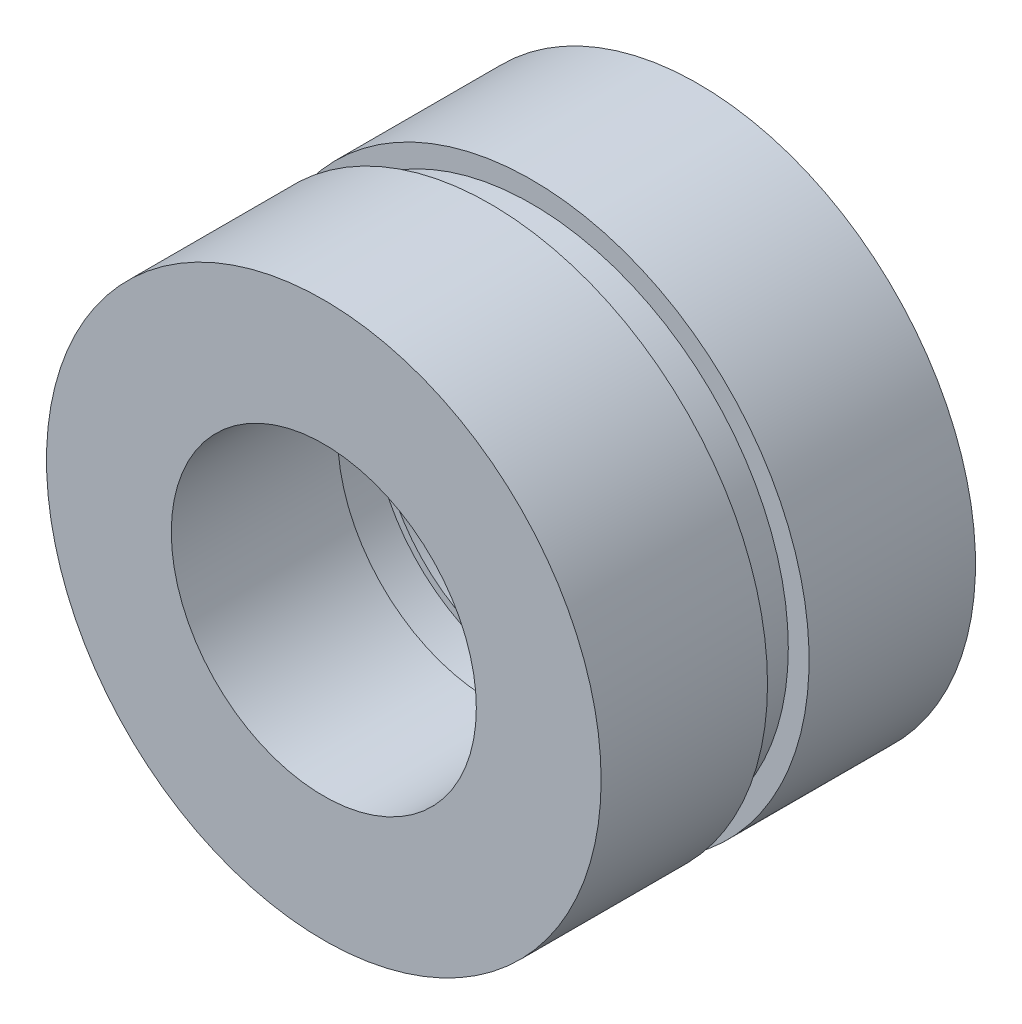
ISO-10303-21;
HEADER;
FILE_DESCRIPTION(('STEP AP214'),'2;1');
FILE_NAME('part.step','',(''),(''),'','','');
FILE_SCHEMA(('AUTOMOTIVE_DESIGN { 1 0 10303 214 1 1 1 1 }'));
ENDSEC;
DATA;
#1=APPLICATION_CONTEXT('core data for automotive mechanical design processes');
#2=APPLICATION_PROTOCOL_DEFINITION('international standard','automotive_design',2000,#1);
#3=PRODUCT_CONTEXT('',#1,'mechanical');
#4=PRODUCT('Part','Part','',(#3));
#5=PRODUCT_RELATED_PRODUCT_CATEGORY('part','',(#4));
#6=PRODUCT_DEFINITION_FORMATION('','',#4);
#7=PRODUCT_DEFINITION_CONTEXT('part definition',#1,'design');
#8=PRODUCT_DEFINITION('design','',#6,#7);
#9=PRODUCT_DEFINITION_SHAPE('','',#8);
#10=(LENGTH_UNIT() NAMED_UNIT(*) SI_UNIT(.MILLI.,.METRE.));
#11=(NAMED_UNIT(*) PLANE_ANGLE_UNIT() SI_UNIT($,.RADIAN.));
#12=(NAMED_UNIT(*) SI_UNIT($,.STERADIAN.) SOLID_ANGLE_UNIT());
#13=UNCERTAINTY_MEASURE_WITH_UNIT(LENGTH_MEASURE(1.E-05),#10,'distance_accuracy_value','');
#14=(GEOMETRIC_REPRESENTATION_CONTEXT(3) GLOBAL_UNCERTAINTY_ASSIGNED_CONTEXT((#13)) GLOBAL_UNIT_ASSIGNED_CONTEXT((#10,
#11,#12)) REPRESENTATION_CONTEXT('',''));
#15=CARTESIAN_POINT('',(0.,0.,0.));
#16=DIRECTION('',(0.,0.,1.));
#17=DIRECTION('',(1.,0.,0.));
#18=AXIS2_PLACEMENT_3D('',#15,#16,#17);
#19=CARTESIAN_POINT('',(0.,0.,-3.048));
#20=DIRECTION('',(0.,0.,-1.));
#21=DIRECTION('',(-1.,0.,0.));
#22=AXIS2_PLACEMENT_3D('',#19,#20,#21);
#23=PLANE('',#22);
#24=CARTESIAN_POINT('',(0.,0.,-3.048));
#25=DIRECTION('',(0.,0.,-1.));
#26=DIRECTION('',(-1.,0.,0.));
#27=AXIS2_PLACEMENT_3D('',#24,#25,#26);
#28=CIRCLE('',#27,5.08);
#29=CARTESIAN_POINT('',(-5.08,0.,-3.048));
#30=VERTEX_POINT('',#29);
#31=EDGE_CURVE('E11',#30,#30,#28,.T.);
#32=ORIENTED_EDGE('',*,*,#31,.T.);
#33=EDGE_LOOP('',(#32));
#34=FACE_BOUND('',#33,.T.);
#35=CARTESIAN_POINT('',(0.,0.,-3.048));
#36=DIRECTION('',(0.,0.,-1.));
#37=DIRECTION('',(-1.,0.,0.));
#38=AXIS2_PLACEMENT_3D('',#35,#36,#37);
#39=CIRCLE('',#38,2.794);
#40=CARTESIAN_POINT('',(-2.794,0.,-3.048));
#41=VERTEX_POINT('',#40);
#42=EDGE_CURVE('E52',#41,#41,#39,.T.);
#43=ORIENTED_EDGE('',*,*,#42,.F.);
#44=EDGE_LOOP('',(#43));
#45=FACE_BOUND('',#44,.T.);
#46=ADVANCED_FACE('F41',(#34,#45),#23,.T.);
#47=CARTESIAN_POINT('',(0.,0.,0.));
#48=DIRECTION('',(0.,0.,-1.));
#49=DIRECTION('',(-1.,0.,0.));
#50=AXIS2_PLACEMENT_3D('',#47,#48,#49);
#51=PLANE('',#50);
#52=CARTESIAN_POINT('',(0.,0.,0.));
#53=DIRECTION('',(0.,0.,-1.));
#54=DIRECTION('',(-1.,0.,0.));
#55=AXIS2_PLACEMENT_3D('',#52,#53,#54);
#56=CIRCLE('',#55,5.08);
#57=CARTESIAN_POINT('',(-5.08,0.,0.));
#58=VERTEX_POINT('',#57);
#59=EDGE_CURVE('E45',#58,#58,#56,.T.);
#60=ORIENTED_EDGE('',*,*,#59,.F.);
#61=EDGE_LOOP('',(#60));
#62=FACE_BOUND('',#61,.T.);
#63=CARTESIAN_POINT('',(0.,0.,0.));
#64=DIRECTION('',(0.,0.,-1.));
#65=DIRECTION('',(-1.,0.,0.));
#66=AXIS2_PLACEMENT_3D('',#63,#64,#65);
#67=CIRCLE('',#66,2.794);
#68=CARTESIAN_POINT('',(-2.794,0.,0.));
#69=VERTEX_POINT('',#68);
#70=EDGE_CURVE('E54',#69,#69,#67,.T.);
#71=ORIENTED_EDGE('',*,*,#70,.T.);
#72=EDGE_LOOP('',(#71));
#73=FACE_BOUND('',#72,.T.);
#74=ADVANCED_FACE('F64',(#62,#73),#51,.F.);
#75=CARTESIAN_POINT('',(0.,0.,-3.048));
#76=DIRECTION('',(0.,0.,1.));
#77=DIRECTION('',(1.,0.,0.));
#78=AXIS2_PLACEMENT_3D('',#75,#76,#77);
#79=CYLINDRICAL_SURFACE('',#78,5.08);
#80=ORIENTED_EDGE('',*,*,#31,.F.);
#81=EDGE_LOOP('',(#80));
#82=FACE_BOUND('',#81,.T.);
#83=ORIENTED_EDGE('',*,*,#59,.T.);
#84=EDGE_LOOP('',(#83));
#85=FACE_BOUND('',#84,.T.);
#86=ADVANCED_FACE('F43',(#82,#85),#79,.T.);
#87=CARTESIAN_POINT('',(0.,0.,-3.048));
#88=DIRECTION('',(0.,0.,1.));
#89=DIRECTION('',(1.,0.,0.));
#90=AXIS2_PLACEMENT_3D('',#87,#88,#89);
#91=CYLINDRICAL_SURFACE('',#90,2.794);
#92=ORIENTED_EDGE('',*,*,#42,.T.);
#93=EDGE_LOOP('',(#92));
#94=FACE_BOUND('',#93,.T.);
#95=ORIENTED_EDGE('',*,*,#70,.F.);
#96=EDGE_LOOP('',(#95));
#97=FACE_BOUND('',#96,.T.);
#98=ADVANCED_FACE('F60',(#94,#97),#91,.F.);
#99=CLOSED_SHELL('',(#46,#74,#86,#98));
#100=MANIFOLD_SOLID_BREP('B2',#99);
#101=CARTESIAN_POINT('',(0.,0.,0.));
#102=DIRECTION('',(0.,0.,1.));
#103=DIRECTION('',(1.,0.,0.));
#104=AXIS2_PLACEMENT_3D('',#101,#102,#103);
#105=PLANE('',#104);
#106=CARTESIAN_POINT('',(0.,0.,0.));
#107=DIRECTION('',(0.,0.,1.));
#108=DIRECTION('',(1.,0.,0.));
#109=AXIS2_PLACEMENT_3D('',#106,#107,#108);
#110=CIRCLE('',#109,4.699);
#111=CARTESIAN_POINT('',(4.699,0.,0.));
#112=VERTEX_POINT('',#111);
#113=EDGE_CURVE('E107',#112,#112,#110,.T.);
#114=ORIENTED_EDGE('',*,*,#113,.F.);
#115=EDGE_LOOP('',(#114));
#116=FACE_BOUND('',#115,.T.);
#117=CARTESIAN_POINT('',(0.,0.,0.));
#118=DIRECTION('',(0.,0.,1.));
#119=DIRECTION('',(1.,0.,0.));
#120=AXIS2_PLACEMENT_3D('',#117,#118,#119);
#121=CIRCLE('',#120,2.921);
#122=CARTESIAN_POINT('',(2.921,0.,0.));
#123=VERTEX_POINT('',#122);
#124=EDGE_CURVE('E114',#123,#123,#121,.T.);
#125=ORIENTED_EDGE('',*,*,#124,.T.);
#126=EDGE_LOOP('',(#125));
#127=FACE_BOUND('',#126,.T.);
#128=ADVANCED_FACE('F103',(#116,#127),#105,.F.);
#129=CARTESIAN_POINT('',(0.,0.,0.762));
#130=DIRECTION('',(0.,0.,-1.));
#131=DIRECTION('',(-1.,0.,0.));
#132=AXIS2_PLACEMENT_3D('',#129,#130,#131);
#133=CYLINDRICAL_SURFACE('',#132,4.699);
#134=CARTESIAN_POINT('',(0.,0.,0.762));
#135=DIRECTION('',(0.,0.,1.));
#136=DIRECTION('',(1.,0.,0.));
#137=AXIS2_PLACEMENT_3D('',#134,#135,#136);
#138=CIRCLE('',#137,4.699);
#139=CARTESIAN_POINT('',(4.699,0.,0.762));
#140=VERTEX_POINT('',#139);
#141=EDGE_CURVE('E40',#140,#140,#138,.T.);
#142=ORIENTED_EDGE('',*,*,#141,.F.);
#143=EDGE_LOOP('',(#142));
#144=FACE_BOUND('',#143,.T.);
#145=ORIENTED_EDGE('',*,*,#113,.T.);
#146=EDGE_LOOP('',(#145));
#147=FACE_BOUND('',#146,.T.);
#148=ADVANCED_FACE('F105',(#144,#147),#133,.T.);
#149=CARTESIAN_POINT('',(0.,0.,0.762));
#150=DIRECTION('',(0.,0.,-1.));
#151=DIRECTION('',(-1.,0.,0.));
#152=AXIS2_PLACEMENT_3D('',#149,#150,#151);
#153=CYLINDRICAL_SURFACE('',#152,2.921);
#154=CARTESIAN_POINT('',(0.,0.,0.762));
#155=DIRECTION('',(0.,0.,1.));
#156=DIRECTION('',(1.,0.,0.));
#157=AXIS2_PLACEMENT_3D('',#154,#155,#156);
#158=CIRCLE('',#157,2.921);
#159=CARTESIAN_POINT('',(2.921,0.,0.762));
#160=VERTEX_POINT('',#159);
#161=EDGE_CURVE('E118',#160,#160,#158,.T.);
#162=ORIENTED_EDGE('',*,*,#161,.T.);
#163=EDGE_LOOP('',(#162));
#164=FACE_BOUND('',#163,.T.);
#165=ORIENTED_EDGE('',*,*,#124,.F.);
#166=EDGE_LOOP('',(#165));
#167=FACE_BOUND('',#166,.T.);
#168=ADVANCED_FACE('F149',(#164,#167),#153,.F.);
#169=CARTESIAN_POINT('',(0.,0.,0.762));
#170=DIRECTION('',(0.,0.,1.));
#171=DIRECTION('',(1.,0.,0.));
#172=AXIS2_PLACEMENT_3D('',#169,#170,#171);
#173=PLANE('',#172);
#174=CARTESIAN_POINT('',(0.,0.,0.762));
#175=DIRECTION('',(0.,0.,1.));
#176=DIRECTION('',(1.,0.,0.));
#177=AXIS2_PLACEMENT_3D('',#174,#175,#176);
#178=CIRCLE('',#177,2.794);
#179=CARTESIAN_POINT('',(2.794,0.,0.762));
#180=VERTEX_POINT('',#179);
#181=EDGE_CURVE('E128',#180,#180,#178,.T.);
#182=ORIENTED_EDGE('',*,*,#181,.T.);
#183=EDGE_LOOP('',(#182));
#184=FACE_BOUND('',#183,.T.);
#185=ORIENTED_EDGE('',*,*,#161,.F.);
#186=EDGE_LOOP('',(#185));
#187=FACE_BOUND('',#186,.T.);
#188=ADVANCED_FACE('F140',(#184,#187),#173,.F.);
#189=CARTESIAN_POINT('',(0.,0.,3.81));
#190=DIRECTION('',(0.,0.,1.));
#191=DIRECTION('',(1.,0.,0.));
#192=AXIS2_PLACEMENT_3D('',#189,#190,#191);
#193=PLANE('',#192);
#194=CARTESIAN_POINT('',(0.,0.,3.81));
#195=DIRECTION('',(0.,0.,1.));
#196=DIRECTION('',(1.,0.,0.));
#197=AXIS2_PLACEMENT_3D('',#194,#195,#196);
#198=CIRCLE('',#197,5.08);
#199=CARTESIAN_POINT('',(5.08,0.,3.81));
#200=VERTEX_POINT('',#199);
#201=EDGE_CURVE('E121',#200,#200,#198,.T.);
#202=ORIENTED_EDGE('',*,*,#201,.T.);
#203=EDGE_LOOP('',(#202));
#204=FACE_BOUND('',#203,.T.);
#205=CARTESIAN_POINT('',(0.,0.,3.81));
#206=DIRECTION('',(0.,0.,1.));
#207=DIRECTION('',(1.,0.,0.));
#208=AXIS2_PLACEMENT_3D('',#205,#206,#207);
#209=CIRCLE('',#208,2.794);
#210=CARTESIAN_POINT('',(2.794,0.,3.81));
#211=VERTEX_POINT('',#210);
#212=EDGE_CURVE('E125',#211,#211,#209,.T.);
#213=ORIENTED_EDGE('',*,*,#212,.F.);
#214=EDGE_LOOP('',(#213));
#215=FACE_BOUND('',#214,.T.);
#216=ADVANCED_FACE('F137',(#204,#215),#193,.T.);
#217=ORIENTED_EDGE('',*,*,#141,.T.);
#218=EDGE_LOOP('',(#217));
#219=FACE_BOUND('',#218,.T.);
#220=CARTESIAN_POINT('',(0.,0.,0.762));
#221=DIRECTION('',(0.,0.,1.));
#222=DIRECTION('',(1.,0.,0.));
#223=AXIS2_PLACEMENT_3D('',#220,#221,#222);
#224=CIRCLE('',#223,5.08);
#225=CARTESIAN_POINT('',(5.08,0.,0.762));
#226=VERTEX_POINT('',#225);
#227=EDGE_CURVE('E122',#226,#226,#224,.T.);
#228=ORIENTED_EDGE('',*,*,#227,.F.);
#229=EDGE_LOOP('',(#228));
#230=FACE_BOUND('',#229,.T.);
#231=ADVANCED_FACE('F139',(#219,#230),#173,.F.);
#232=CARTESIAN_POINT('',(0.,0.,3.81));
#233=DIRECTION('',(0.,0.,-1.));
#234=DIRECTION('',(-1.,0.,0.));
#235=AXIS2_PLACEMENT_3D('',#232,#233,#234);
#236=CYLINDRICAL_SURFACE('',#235,5.08);
#237=ORIENTED_EDGE('',*,*,#201,.F.);
#238=EDGE_LOOP('',(#237));
#239=FACE_BOUND('',#238,.T.);
#240=ORIENTED_EDGE('',*,*,#227,.T.);
#241=EDGE_LOOP('',(#240));
#242=FACE_BOUND('',#241,.T.);
#243=ADVANCED_FACE('F147',(#239,#242),#236,.T.);
#244=CARTESIAN_POINT('',(0.,0.,3.81));
#245=DIRECTION('',(0.,0.,-1.));
#246=DIRECTION('',(-1.,0.,0.));
#247=AXIS2_PLACEMENT_3D('',#244,#245,#246);
#248=CYLINDRICAL_SURFACE('',#247,2.794);
#249=ORIENTED_EDGE('',*,*,#212,.T.);
#250=EDGE_LOOP('',(#249));
#251=FACE_BOUND('',#250,.T.);
#252=ORIENTED_EDGE('',*,*,#181,.F.);
#253=EDGE_LOOP('',(#252));
#254=FACE_BOUND('',#253,.T.);
#255=ADVANCED_FACE('F134',(#251,#254),#248,.F.);
#256=CLOSED_SHELL('',(#128,#148,#168,#188,#216,#231,#243,#255));
#257=MANIFOLD_SOLID_BREP('B6',#256);
#258=ADVANCED_BREP_SHAPE_REPRESENTATION('',(#18,#100,#257),#14);
#259=SHAPE_DEFINITION_REPRESENTATION(#9,#258);
ENDSEC;
END-ISO-10303-21;
